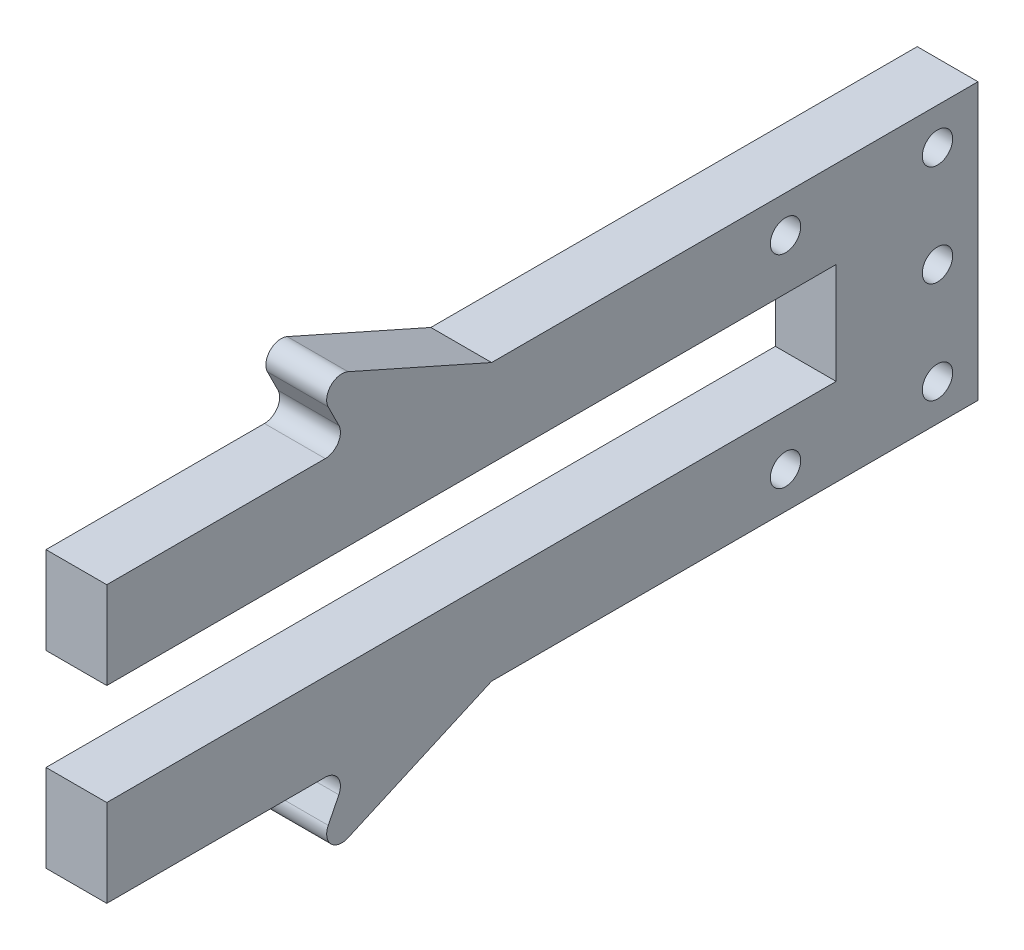
ISO-10303-21;
HEADER;
FILE_DESCRIPTION(('STEP AP214'),'2;1');
FILE_NAME('part.step','',(''),(''),'','','');
FILE_SCHEMA(('AUTOMOTIVE_DESIGN { 1 0 10303 214 1 1 1 1 }'));
ENDSEC;
DATA;
#1=APPLICATION_CONTEXT('core data for automotive mechanical design processes');
#2=APPLICATION_PROTOCOL_DEFINITION('international standard','automotive_design',2000,#1);
#3=PRODUCT_CONTEXT('',#1,'mechanical');
#4=PRODUCT('Part','Part','',(#3));
#5=PRODUCT_RELATED_PRODUCT_CATEGORY('part','',(#4));
#6=PRODUCT_DEFINITION_FORMATION('','',#4);
#7=PRODUCT_DEFINITION_CONTEXT('part definition',#1,'design');
#8=PRODUCT_DEFINITION('design','',#6,#7);
#9=PRODUCT_DEFINITION_SHAPE('','',#8);
#10=(LENGTH_UNIT() NAMED_UNIT(*) SI_UNIT(.MILLI.,.METRE.));
#11=(NAMED_UNIT(*) PLANE_ANGLE_UNIT() SI_UNIT($,.RADIAN.));
#12=(NAMED_UNIT(*) SI_UNIT($,.STERADIAN.) SOLID_ANGLE_UNIT());
#13=UNCERTAINTY_MEASURE_WITH_UNIT(LENGTH_MEASURE(1.E-05),#10,'distance_accuracy_value','');
#14=(GEOMETRIC_REPRESENTATION_CONTEXT(3) GLOBAL_UNCERTAINTY_ASSIGNED_CONTEXT((#13)) GLOBAL_UNIT_ASSIGNED_CONTEXT((#10,
#11,#12)) REPRESENTATION_CONTEXT('',''));
#15=CARTESIAN_POINT('',(0.,0.,0.));
#16=DIRECTION('',(0.,0.,1.));
#17=DIRECTION('',(1.,0.,0.));
#18=AXIS2_PLACEMENT_3D('',#15,#16,#17);
#19=CARTESIAN_POINT('',(3.,-8.69886308258413,20.913575794308));
#20=DIRECTION('',(0.,0.,-1.));
#21=DIRECTION('',(-1.,0.,0.));
#22=AXIS2_PLACEMENT_3D('',#19,#20,#21);
#23=PLANE('',#22);
#24=DIRECTION('',(0.,-1.,0.));
#25=VECTOR('',#24,1.);
#26=CARTESIAN_POINT('',(0.,-8.69886308258413,20.913575794308));
#27=LINE('',#26,#25);
#28=CARTESIAN_POINT('',(0.,-4.38851825499793,20.913575794308));
#29=VERTEX_POINT('',#28);
#30=CARTESIAN_POINT('',(0.,-8.69886308258413,20.913575794308));
#31=VERTEX_POINT('',#30);
#32=EDGE_CURVE('E182',#29,#31,#27,.T.);
#33=ORIENTED_EDGE('',*,*,#32,.T.);
#34=DIRECTION('',(-1.,0.,0.));
#35=VECTOR('',#34,1.);
#36=CARTESIAN_POINT('',(3.,-8.69886308258413,20.913575794308));
#37=LINE('',#36,#35);
#38=CARTESIAN_POINT('',(3.,-8.69886308258413,20.913575794308));
#39=VERTEX_POINT('',#38);
#40=EDGE_CURVE('E164',#39,#31,#37,.T.);
#41=ORIENTED_EDGE('',*,*,#40,.F.);
#42=DIRECTION('',(0.,-1.,0.));
#43=VECTOR('',#42,1.);
#44=CARTESIAN_POINT('',(3.,-8.69886308258413,20.913575794308));
#45=LINE('',#44,#43);
#46=CARTESIAN_POINT('',(3.,-4.38851825499793,20.913575794308));
#47=VERTEX_POINT('',#46);
#48=EDGE_CURVE('E170',#47,#39,#45,.T.);
#49=ORIENTED_EDGE('',*,*,#48,.F.);
#50=DIRECTION('',(-1.,0.,0.));
#51=VECTOR('',#50,1.);
#52=CARTESIAN_POINT('',(3.,-4.38851825499793,20.913575794308));
#53=LINE('',#52,#51);
#54=EDGE_CURVE('E233',#47,#29,#53,.T.);
#55=ORIENTED_EDGE('',*,*,#54,.T.);
#56=EDGE_LOOP('',(#33,#41,#49,#55));
#57=FACE_BOUND('',#56,.T.);
#58=ADVANCED_FACE('F35',(#57),#23,.F.);
#59=CARTESIAN_POINT('',(3.,-8.69886308258413,-15.086424205692));
#60=DIRECTION('',(0.,1.,0.));
#61=DIRECTION('',(0.,0.,1.));
#62=AXIS2_PLACEMENT_3D('',#59,#60,#61);
#63=PLANE('',#62);
#64=DIRECTION('',(0.,0.,-1.));
#65=VECTOR('',#64,1.);
#66=CARTESIAN_POINT('',(0.,-8.69886308258413,-15.086424205692));
#67=LINE('',#66,#65);
#68=CARTESIAN_POINT('',(0.,-8.69886308258413,-15.086424205692));
#69=VERTEX_POINT('',#68);
#70=EDGE_CURVE('E243',#31,#69,#67,.T.);
#71=ORIENTED_EDGE('',*,*,#70,.T.);
#72=DIRECTION('',(-1.,0.,0.));
#73=VECTOR('',#72,1.);
#74=CARTESIAN_POINT('',(3.,-8.69886308258413,-15.086424205692));
#75=LINE('',#74,#73);
#76=CARTESIAN_POINT('',(3.,-8.69886308258413,-15.086424205692));
#77=VERTEX_POINT('',#76);
#78=EDGE_CURVE('E167',#77,#69,#75,.T.);
#79=ORIENTED_EDGE('',*,*,#78,.F.);
#80=DIRECTION('',(0.,0.,-1.));
#81=VECTOR('',#80,1.);
#82=CARTESIAN_POINT('',(3.,-8.69886308258413,-15.086424205692));
#83=LINE('',#82,#81);
#84=EDGE_CURVE('E160',#39,#77,#83,.T.);
#85=ORIENTED_EDGE('',*,*,#84,.F.);
#86=ORIENTED_EDGE('',*,*,#40,.T.);
#87=EDGE_LOOP('',(#71,#79,#85,#86));
#88=FACE_BOUND('',#87,.T.);
#89=ADVANCED_FACE('F162',(#88),#63,.F.);
#90=CARTESIAN_POINT('',(3.,-13.6988630825841,-15.086424205692));
#91=DIRECTION('',(0.,0.,-1.));
#92=DIRECTION('',(0.,1.,0.));
#93=AXIS2_PLACEMENT_3D('',#90,#91,#92);
#94=PLANE('',#93);
#95=DIRECTION('',(0.,-1.,0.));
#96=VECTOR('',#95,1.);
#97=CARTESIAN_POINT('',(0.,-13.6988630825841,-15.086424205692));
#98=LINE('',#97,#96);
#99=CARTESIAN_POINT('',(0.,-13.6988630825841,-15.086424205692));
#100=VERTEX_POINT('',#99);
#101=EDGE_CURVE('E246',#69,#100,#98,.T.);
#102=ORIENTED_EDGE('',*,*,#101,.T.);
#103=DIRECTION('',(-1.,0.,0.));
#104=VECTOR('',#103,1.);
#105=CARTESIAN_POINT('',(3.,-13.6988630825841,-15.086424205692));
#106=LINE('',#105,#104);
#107=CARTESIAN_POINT('',(3.,-13.6988630825841,-15.086424205692));
#108=VERTEX_POINT('',#107);
#109=EDGE_CURVE('E188',#108,#100,#106,.T.);
#110=ORIENTED_EDGE('',*,*,#109,.F.);
#111=DIRECTION('',(0.,-1.,0.));
#112=VECTOR('',#111,1.);
#113=CARTESIAN_POINT('',(3.,-13.6988630825841,-15.086424205692));
#114=LINE('',#113,#112);
#115=EDGE_CURVE('E169',#77,#108,#114,.T.);
#116=ORIENTED_EDGE('',*,*,#115,.F.);
#117=ORIENTED_EDGE('',*,*,#78,.T.);
#118=EDGE_LOOP('',(#102,#110,#116,#117));
#119=FACE_BOUND('',#118,.T.);
#120=ADVANCED_FACE('F373',(#119),#94,.F.);
#121=CARTESIAN_POINT('',(3.,-13.6988630825841,20.913575794308));
#122=DIRECTION('',(0.,-1.,0.));
#123=DIRECTION('',(0.,0.,-1.));
#124=AXIS2_PLACEMENT_3D('',#121,#122,#123);
#125=PLANE('',#124);
#126=DIRECTION('',(0.,0.,1.));
#127=VECTOR('',#126,1.);
#128=CARTESIAN_POINT('',(0.,-13.6988630825841,20.913575794308));
#129=LINE('',#128,#127);
#130=CARTESIAN_POINT('',(0.,-13.6988630825841,20.913575794308));
#131=VERTEX_POINT('',#130);
#132=EDGE_CURVE('E248',#100,#131,#129,.T.);
#133=ORIENTED_EDGE('',*,*,#132,.T.);
#134=DIRECTION('',(-1.,0.,0.));
#135=VECTOR('',#134,1.);
#136=CARTESIAN_POINT('',(3.,-13.6988630825841,20.913575794308));
#137=LINE('',#136,#135);
#138=CARTESIAN_POINT('',(3.,-13.6988630825841,20.913575794308));
#139=VERTEX_POINT('',#138);
#140=EDGE_CURVE('E283',#139,#131,#137,.T.);
#141=ORIENTED_EDGE('',*,*,#140,.F.);
#142=DIRECTION('',(0.,0.,1.));
#143=VECTOR('',#142,1.);
#144=CARTESIAN_POINT('',(3.,-13.6988630825841,20.913575794308));
#145=LINE('',#144,#143);
#146=EDGE_CURVE('E292',#108,#139,#145,.T.);
#147=ORIENTED_EDGE('',*,*,#146,.F.);
#148=ORIENTED_EDGE('',*,*,#109,.T.);
#149=EDGE_LOOP('',(#133,#141,#147,#148));
#150=FACE_BOUND('',#149,.T.);
#151=ADVANCED_FACE('F290',(#150),#125,.F.);
#152=CARTESIAN_POINT('',(3.,-18.0092079101703,20.913575794308));
#153=DIRECTION('',(0.,0.,-1.));
#154=DIRECTION('',(-1.,0.,0.));
#155=AXIS2_PLACEMENT_3D('',#152,#153,#154);
#156=PLANE('',#155);
#157=DIRECTION('',(0.,-1.,0.));
#158=VECTOR('',#157,1.);
#159=CARTESIAN_POINT('',(0.,-18.0092079101703,20.913575794308));
#160=LINE('',#159,#158);
#161=CARTESIAN_POINT('',(0.,-18.0092079101703,20.913575794308));
#162=VERTEX_POINT('',#161);
#163=EDGE_CURVE('E250',#131,#162,#160,.T.);
#164=ORIENTED_EDGE('',*,*,#163,.T.);
#165=DIRECTION('',(-1.,0.,0.));
#166=VECTOR('',#165,1.);
#167=CARTESIAN_POINT('',(3.,-18.0092079101703,20.913575794308));
#168=LINE('',#167,#166);
#169=CARTESIAN_POINT('',(3.,-18.0092079101703,20.913575794308));
#170=VERTEX_POINT('',#169);
#171=EDGE_CURVE('E280',#170,#162,#168,.T.);
#172=ORIENTED_EDGE('',*,*,#171,.F.);
#173=DIRECTION('',(0.,-1.,0.));
#174=VECTOR('',#173,1.);
#175=CARTESIAN_POINT('',(3.,-18.0092079101703,20.913575794308));
#176=LINE('',#175,#174);
#177=EDGE_CURVE('E309',#139,#170,#176,.T.);
#178=ORIENTED_EDGE('',*,*,#177,.F.);
#179=ORIENTED_EDGE('',*,*,#140,.T.);
#180=EDGE_LOOP('',(#164,#172,#178,#179));
#181=FACE_BOUND('',#180,.T.);
#182=ADVANCED_FACE('F299',(#181),#156,.F.);
#183=CARTESIAN_POINT('',(3.,-18.0092079101703,8.91960191493356));
#184=DIRECTION('',(0.,1.,0.));
#185=DIRECTION('',(0.,0.,1.));
#186=AXIS2_PLACEMENT_3D('',#183,#184,#185);
#187=PLANE('',#186);
#188=DIRECTION('',(0.,0.,-1.));
#189=VECTOR('',#188,1.);
#190=CARTESIAN_POINT('',(0.,-18.0092079101703,8.91960191493356));
#191=LINE('',#190,#189);
#192=CARTESIAN_POINT('',(0.,-18.0092079101703,10.1314928126762));
#193=VERTEX_POINT('',#192);
#194=EDGE_CURVE('E252',#162,#193,#191,.T.);
#195=ORIENTED_EDGE('',*,*,#194,.T.);
#196=DIRECTION('',(-1.,0.,0.));
#197=VECTOR('',#196,1.);
#198=CARTESIAN_POINT('',(3.,-18.0092079101703,10.1314928126762));
#199=LINE('',#198,#197);
#200=CARTESIAN_POINT('',(3.,-18.0092079101703,10.1314928126762));
#201=VERTEX_POINT('',#200);
#202=EDGE_CURVE('E204',#193,#201,#199,.F.);
#203=ORIENTED_EDGE('',*,*,#202,.T.);
#204=DIRECTION('',(0.,0.,-1.));
#205=VECTOR('',#204,1.);
#206=CARTESIAN_POINT('',(3.,-18.0092079101703,8.91960191493356));
#207=LINE('',#206,#205);
#208=EDGE_CURVE('E306',#170,#201,#207,.T.);
#209=ORIENTED_EDGE('',*,*,#208,.F.);
#210=ORIENTED_EDGE('',*,*,#171,.T.);
#211=EDGE_LOOP('',(#195,#203,#209,#210));
#212=FACE_BOUND('',#211,.T.);
#213=ADVANCED_FACE('F303',(#212),#187,.F.);
#214=CARTESIAN_POINT('',(3.,-22.0092079101703,10.913575794308));
#215=DIRECTION('',(0.,-0.446134635862029,-0.894965857831601));
#216=DIRECTION('',(0.,0.894965857831602,-0.446134635862029));
#217=AXIS2_PLACEMENT_3D('',#214,#215,#216);
#218=PLANE('',#217);
#219=DIRECTION('',(0.,-0.894965857831602,0.446134635862029));
#220=VECTOR('',#219,1.);
#221=CARTESIAN_POINT('',(0.,-22.0092079101703,10.913575794308));
#222=LINE('',#221,#220);
#223=CARTESIAN_POINT('',(0.,-19.0938088870669,9.46026841930247));
#224=VERTEX_POINT('',#223);
#225=CARTESIAN_POINT('',(0.,-20.1410931179854,9.98233276948552));
#226=VERTEX_POINT('',#225);
#227=EDGE_CURVE('E255',#224,#226,#222,.T.);
#228=ORIENTED_EDGE('',*,*,#227,.T.);
#229=DIRECTION('',(-1.,0.,0.));
#230=VECTOR('',#229,1.);
#231=CARTESIAN_POINT('',(3.,-20.1410931179854,9.98233276948552));
#232=LINE('',#231,#230);
#233=CARTESIAN_POINT('',(3.,-20.1410931179854,9.98233276948552));
#234=VERTEX_POINT('',#233);
#235=EDGE_CURVE('E198',#226,#234,#232,.F.);
#236=ORIENTED_EDGE('',*,*,#235,.T.);
#237=DIRECTION('',(0.,-0.894965857831602,0.446134635862029));
#238=VECTOR('',#237,1.);
#239=CARTESIAN_POINT('',(3.,-22.0092079101703,10.913575794308));
#240=LINE('',#239,#238);
#241=CARTESIAN_POINT('',(3.,-19.0938088870669,9.46026841930247));
#242=VERTEX_POINT('',#241);
#243=EDGE_CURVE('E308',#242,#234,#240,.T.);
#244=ORIENTED_EDGE('',*,*,#243,.F.);
#245=DIRECTION('',(-1.,0.,0.));
#246=VECTOR('',#245,1.);
#247=CARTESIAN_POINT('',(0.,-19.0938088870669,9.46026841930247));
#248=LINE('',#247,#246);
#249=EDGE_CURVE('E195',#242,#224,#248,.T.);
#250=ORIENTED_EDGE('',*,*,#249,.T.);
#251=EDGE_LOOP('',(#228,#236,#244,#250));
#252=FACE_BOUND('',#251,.T.);
#253=ADVANCED_FACE('F354',(#252),#218,.F.);
#254=CARTESIAN_POINT('',(3.,-18.0092079101703,1.91960191493357));
#255=DIRECTION('',(0.,0.913710538579925,0.406365662535583));
#256=DIRECTION('',(0.,-0.406365662535583,0.913710538579925));
#257=AXIS2_PLACEMENT_3D('',#254,#255,#256);
#258=PLANE('',#257);
#259=DIRECTION('',(0.,0.406365662535583,-0.913710538579925));
#260=VECTOR('',#259,1.);
#261=CARTESIAN_POINT('',(3.,-18.0092079101703,1.91960191493357));
#262=LINE('',#261,#260);
#263=CARTESIAN_POINT('',(3.,-21.1609769988168,9.00633412921013));
#264=VERTEX_POINT('',#263);
#265=CARTESIAN_POINT('',(3.,-18.0092079101703,1.91960191493357));
#266=VERTEX_POINT('',#265);
#267=EDGE_CURVE('E311',#264,#266,#262,.T.);
#268=ORIENTED_EDGE('',*,*,#267,.F.);
#269=DIRECTION('',(-1.,0.,0.));
#270=VECTOR('',#269,1.);
#271=CARTESIAN_POINT('',(3.,-21.1609769988168,9.00633412921013));
#272=LINE('',#271,#270);
#273=CARTESIAN_POINT('',(0.,-21.1609769988168,9.00633412921013));
#274=VERTEX_POINT('',#273);
#275=EDGE_CURVE('E183',#264,#274,#272,.T.);
#276=ORIENTED_EDGE('',*,*,#275,.T.);
#277=DIRECTION('',(0.,0.406365662535583,-0.913710538579925));
#278=VECTOR('',#277,1.);
#279=CARTESIAN_POINT('',(0.,-18.0092079101703,1.91960191493357));
#280=LINE('',#279,#278);
#281=CARTESIAN_POINT('',(0.,-18.0092079101703,1.91960191493357));
#282=VERTEX_POINT('',#281);
#283=EDGE_CURVE('E258',#274,#282,#280,.T.);
#284=ORIENTED_EDGE('',*,*,#283,.T.);
#285=DIRECTION('',(-1.,0.,0.));
#286=VECTOR('',#285,1.);
#287=CARTESIAN_POINT('',(3.,-18.0092079101703,1.91960191493357));
#288=LINE('',#287,#286);
#289=EDGE_CURVE('E277',#266,#282,#288,.T.);
#290=ORIENTED_EDGE('',*,*,#289,.F.);
#291=EDGE_LOOP('',(#268,#276,#284,#290));
#292=FACE_BOUND('',#291,.T.);
#293=ADVANCED_FACE('F348',(#292),#258,.F.);
#294=CARTESIAN_POINT('',(3.,-18.0092079101703,-22.086424205692));
#295=DIRECTION('',(0.,1.,0.));
#296=DIRECTION('',(0.,0.,1.));
#297=AXIS2_PLACEMENT_3D('',#294,#295,#296);
#298=PLANE('',#297);
#299=DIRECTION('',(0.,0.,-1.));
#300=VECTOR('',#299,1.);
#301=CARTESIAN_POINT('',(0.,-18.0092079101703,-22.086424205692));
#302=LINE('',#301,#300);
#303=CARTESIAN_POINT('',(0.,-18.0092079101703,-22.086424205692));
#304=VERTEX_POINT('',#303);
#305=EDGE_CURVE('E260',#282,#304,#302,.T.);
#306=ORIENTED_EDGE('',*,*,#305,.T.);
#307=DIRECTION('',(-1.,0.,0.));
#308=VECTOR('',#307,1.);
#309=CARTESIAN_POINT('',(3.,-18.0092079101703,-22.086424205692));
#310=LINE('',#309,#308);
#311=CARTESIAN_POINT('',(3.,-18.0092079101703,-22.086424205692));
#312=VERTEX_POINT('',#311);
#313=EDGE_CURVE('E274',#312,#304,#310,.T.);
#314=ORIENTED_EDGE('',*,*,#313,.F.);
#315=DIRECTION('',(0.,0.,-1.));
#316=VECTOR('',#315,1.);
#317=CARTESIAN_POINT('',(3.,-18.0092079101703,-22.086424205692));
#318=LINE('',#317,#316);
#319=EDGE_CURVE('E317',#266,#312,#318,.T.);
#320=ORIENTED_EDGE('',*,*,#319,.F.);
#321=ORIENTED_EDGE('',*,*,#289,.T.);
#322=EDGE_LOOP('',(#306,#314,#320,#321));
#323=FACE_BOUND('',#322,.T.);
#324=ADVANCED_FACE('F344',(#323),#298,.F.);
#325=CARTESIAN_POINT('',(3.,-4.38851825499794,-22.086424205692));
#326=DIRECTION('',(0.,0.,1.));
#327=DIRECTION('',(1.,0.,0.));
#328=AXIS2_PLACEMENT_3D('',#325,#326,#327);
#329=PLANE('',#328);
#330=DIRECTION('',(0.,1.,0.));
#331=VECTOR('',#330,1.);
#332=CARTESIAN_POINT('',(0.,-4.38851825499794,-22.086424205692));
#333=LINE('',#332,#331);
#334=CARTESIAN_POINT('',(0.,-4.38851825499794,-22.086424205692));
#335=VERTEX_POINT('',#334);
#336=EDGE_CURVE('E262',#304,#335,#333,.T.);
#337=ORIENTED_EDGE('',*,*,#336,.T.);
#338=DIRECTION('',(-1.,0.,0.));
#339=VECTOR('',#338,1.);
#340=CARTESIAN_POINT('',(3.,-4.38851825499794,-22.086424205692));
#341=LINE('',#340,#339);
#342=CARTESIAN_POINT('',(3.,-4.38851825499794,-22.086424205692));
#343=VERTEX_POINT('',#342);
#344=EDGE_CURVE('E271',#343,#335,#341,.T.);
#345=ORIENTED_EDGE('',*,*,#344,.F.);
#346=DIRECTION('',(0.,1.,0.));
#347=VECTOR('',#346,1.);
#348=CARTESIAN_POINT('',(3.,-4.38851825499794,-22.086424205692));
#349=LINE('',#348,#347);
#350=EDGE_CURVE('E319',#312,#343,#349,.T.);
#351=ORIENTED_EDGE('',*,*,#350,.F.);
#352=ORIENTED_EDGE('',*,*,#313,.T.);
#353=EDGE_LOOP('',(#337,#345,#351,#352));
#354=FACE_BOUND('',#353,.T.);
#355=ADVANCED_FACE('F339',(#354),#329,.F.);
#356=CARTESIAN_POINT('',(3.,-4.38851825499793,1.91960191493359));
#357=DIRECTION('',(0.,-1.,0.));
#358=DIRECTION('',(0.,0.,-1.));
#359=AXIS2_PLACEMENT_3D('',#356,#357,#358);
#360=PLANE('',#359);
#361=DIRECTION('',(0.,0.,1.));
#362=VECTOR('',#361,1.);
#363=CARTESIAN_POINT('',(0.,-4.38851825499793,1.91960191493359));
#364=LINE('',#363,#362);
#365=CARTESIAN_POINT('',(0.,-4.38851825499793,1.91960191493359));
#366=VERTEX_POINT('',#365);
#367=EDGE_CURVE('E264',#335,#366,#364,.T.);
#368=ORIENTED_EDGE('',*,*,#367,.T.);
#369=DIRECTION('',(-1.,0.,0.));
#370=VECTOR('',#369,1.);
#371=CARTESIAN_POINT('',(3.,-4.38851825499793,1.91960191493359));
#372=LINE('',#371,#370);
#373=CARTESIAN_POINT('',(3.,-4.38851825499793,1.91960191493359));
#374=VERTEX_POINT('',#373);
#375=EDGE_CURVE('E236',#374,#366,#372,.T.);
#376=ORIENTED_EDGE('',*,*,#375,.F.);
#377=DIRECTION('',(0.,0.,1.));
#378=VECTOR('',#377,1.);
#379=CARTESIAN_POINT('',(3.,-4.38851825499793,1.91960191493359));
#380=LINE('',#379,#378);
#381=EDGE_CURVE('E321',#343,#374,#380,.T.);
#382=ORIENTED_EDGE('',*,*,#381,.F.);
#383=ORIENTED_EDGE('',*,*,#344,.T.);
#384=EDGE_LOOP('',(#368,#376,#382,#383));
#385=FACE_BOUND('',#384,.T.);
#386=ADVANCED_FACE('F334',(#385),#360,.F.);
#387=CARTESIAN_POINT('',(3.,-4.38851825499793,1.91960191493359));
#388=DIRECTION('',(0.,-0.913710538579925,0.406365662535582));
#389=DIRECTION('',(0.,-0.406365662535583,-0.913710538579925));
#390=AXIS2_PLACEMENT_3D('',#387,#388,#389);
#391=PLANE('',#390);
#392=DIRECTION('',(0.,0.406365662535583,0.913710538579925));
#393=VECTOR('',#392,1.);
#394=CARTESIAN_POINT('',(0.,-4.38851825499793,1.91960191493359));
#395=LINE('',#394,#393);
#396=CARTESIAN_POINT('',(0.,-1.23674916635143,9.00633412921016));
#397=VERTEX_POINT('',#396);
#398=EDGE_CURVE('E228',#366,#397,#395,.T.);
#399=ORIENTED_EDGE('',*,*,#398,.T.);
#400=DIRECTION('',(-1.,0.,0.));
#401=VECTOR('',#400,1.);
#402=CARTESIAN_POINT('',(3.,-1.23674916635143,9.00633412921016));
#403=LINE('',#402,#401);
#404=CARTESIAN_POINT('',(3.,-1.23674916635143,9.00633412921016));
#405=VERTEX_POINT('',#404);
#406=EDGE_CURVE('E213',#397,#405,#403,.F.);
#407=ORIENTED_EDGE('',*,*,#406,.T.);
#408=DIRECTION('',(0.,0.406365662535583,0.913710538579925));
#409=VECTOR('',#408,1.);
#410=CARTESIAN_POINT('',(3.,-4.38851825499793,1.91960191493359));
#411=LINE('',#410,#409);
#412=EDGE_CURVE('E238',#374,#405,#411,.T.);
#413=ORIENTED_EDGE('',*,*,#412,.F.);
#414=ORIENTED_EDGE('',*,*,#375,.T.);
#415=EDGE_LOOP('',(#399,#407,#413,#414));
#416=FACE_BOUND('',#415,.T.);
#417=ADVANCED_FACE('F332',(#416),#391,.F.);
#418=CARTESIAN_POINT('',(3.,-0.388518254997929,10.913575794308));
#419=DIRECTION('',(0.,0.446134635862029,-0.894965857831602));
#420=DIRECTION('',(0.,0.894965857831602,0.446134635862029));
#421=AXIS2_PLACEMENT_3D('',#418,#419,#420);
#422=PLANE('',#421);
#423=DIRECTION('',(0.,-0.894965857831602,-0.446134635862029));
#424=VECTOR('',#423,1.);
#425=CARTESIAN_POINT('',(0.,-0.388518254997929,10.913575794308));
#426=LINE('',#425,#424);
#427=CARTESIAN_POINT('',(0.,-2.25663304718289,9.98233276948555));
#428=VERTEX_POINT('',#427);
#429=CARTESIAN_POINT('',(0.,-3.30391727810141,9.46026841930249));
#430=VERTEX_POINT('',#429);
#431=EDGE_CURVE('E223',#428,#430,#426,.T.);
#432=ORIENTED_EDGE('',*,*,#431,.T.);
#433=DIRECTION('',(-1.,0.,0.));
#434=VECTOR('',#433,1.);
#435=CARTESIAN_POINT('',(3.,-3.30391727810141,9.46026841930249));
#436=LINE('',#435,#434);
#437=CARTESIAN_POINT('',(3.,-3.30391727810141,9.46026841930249));
#438=VERTEX_POINT('',#437);
#439=EDGE_CURVE('E56',#430,#438,#436,.F.);
#440=ORIENTED_EDGE('',*,*,#439,.T.);
#441=DIRECTION('',(0.,-0.894965857831602,-0.446134635862029));
#442=VECTOR('',#441,1.);
#443=CARTESIAN_POINT('',(3.,-0.388518254997929,10.913575794308));
#444=LINE('',#443,#442);
#445=CARTESIAN_POINT('',(3.,-2.25663304718289,9.98233276948555));
#446=VERTEX_POINT('',#445);
#447=EDGE_CURVE('E234',#446,#438,#444,.T.);
#448=ORIENTED_EDGE('',*,*,#447,.F.);
#449=DIRECTION('',(-1.,0.,0.));
#450=VECTOR('',#449,1.);
#451=CARTESIAN_POINT('',(3.,-2.25663304718289,9.98233276948555));
#452=LINE('',#451,#450);
#453=EDGE_CURVE('E209',#446,#428,#452,.T.);
#454=ORIENTED_EDGE('',*,*,#453,.T.);
#455=EDGE_LOOP('',(#432,#440,#448,#454));
#456=FACE_BOUND('',#455,.T.);
#457=ADVANCED_FACE('F226',(#456),#422,.F.);
#458=CARTESIAN_POINT('',(3.,-4.38851825499793,20.913575794308));
#459=DIRECTION('',(0.,-1.,0.));
#460=DIRECTION('',(0.,0.,-1.));
#461=AXIS2_PLACEMENT_3D('',#458,#459,#460);
#462=PLANE('',#461);
#463=DIRECTION('',(0.,0.,1.));
#464=VECTOR('',#463,1.);
#465=CARTESIAN_POINT('',(3.,-4.38851825499793,20.913575794308));
#466=LINE('',#465,#464);
#467=CARTESIAN_POINT('',(3.,-4.38851825499793,10.1314928126762));
#468=VERTEX_POINT('',#467);
#469=EDGE_CURVE('E175',#468,#47,#466,.T.);
#470=ORIENTED_EDGE('',*,*,#469,.F.);
#471=DIRECTION('',(-1.,0.,0.));
#472=VECTOR('',#471,1.);
#473=CARTESIAN_POINT('',(0.,-4.38851825499793,10.1314928126762));
#474=LINE('',#473,#472);
#475=CARTESIAN_POINT('',(0.,-4.38851825499793,10.1314928126762));
#476=VERTEX_POINT('',#475);
#477=EDGE_CURVE('E206',#468,#476,#474,.T.);
#478=ORIENTED_EDGE('',*,*,#477,.T.);
#479=DIRECTION('',(0.,0.,1.));
#480=VECTOR('',#479,1.);
#481=CARTESIAN_POINT('',(0.,-4.38851825499793,20.913575794308));
#482=LINE('',#481,#480);
#483=EDGE_CURVE('E179',#476,#29,#482,.T.);
#484=ORIENTED_EDGE('',*,*,#483,.T.);
#485=ORIENTED_EDGE('',*,*,#54,.F.);
#486=EDGE_LOOP('',(#470,#478,#484,#485));
#487=FACE_BOUND('',#486,.T.);
#488=ADVANCED_FACE('F232',(#487),#462,.F.);
#489=CARTESIAN_POINT('',(3.,0.,0.));
#490=DIRECTION('',(-1.,0.,0.));
#491=DIRECTION('',(0.,0.,1.));
#492=AXIS2_PLACEMENT_3D('',#489,#490,#491);
#493=PLANE('',#492);
#494=CARTESIAN_POINT('',(3.,-16.1988630825841,-20.086424205692));
#495=DIRECTION('',(1.,0.,0.));
#496=DIRECTION('',(0.,0.,-1.));
#497=AXIS2_PLACEMENT_3D('',#494,#495,#496);
#498=CIRCLE('',#497,0.750000000000002);
#499=CARTESIAN_POINT('',(3.,-16.1988630825841,-20.836424205692));
#500=VERTEX_POINT('',#499);
#501=EDGE_CURVE('E449',#500,#500,#498,.T.);
#502=ORIENTED_EDGE('',*,*,#501,.F.);
#503=EDGE_LOOP('',(#502));
#504=FACE_BOUND('',#503,.T.);
#505=CARTESIAN_POINT('',(3.,-6.19886308258413,-12.586424205692));
#506=DIRECTION('',(1.,0.,0.));
#507=DIRECTION('',(0.,0.,-1.));
#508=AXIS2_PLACEMENT_3D('',#505,#506,#507);
#509=CIRCLE('',#508,0.75);
#510=CARTESIAN_POINT('',(3.,-6.19886308258413,-13.336424205692));
#511=VERTEX_POINT('',#510);
#512=EDGE_CURVE('E437',#511,#511,#509,.T.);
#513=ORIENTED_EDGE('',*,*,#512,.F.);
#514=EDGE_LOOP('',(#513));
#515=FACE_BOUND('',#514,.T.);
#516=CARTESIAN_POINT('',(3.,-11.1988630825841,-20.086424205692));
#517=DIRECTION('',(1.,0.,0.));
#518=DIRECTION('',(0.,0.,-1.));
#519=AXIS2_PLACEMENT_3D('',#516,#517,#518);
#520=CIRCLE('',#519,0.750000000000002);
#521=CARTESIAN_POINT('',(3.,-11.1988630825841,-20.836424205692));
#522=VERTEX_POINT('',#521);
#523=EDGE_CURVE('E433',#522,#522,#520,.T.);
#524=ORIENTED_EDGE('',*,*,#523,.F.);
#525=EDGE_LOOP('',(#524));
#526=FACE_BOUND('',#525,.T.);
#527=CARTESIAN_POINT('',(3.,-16.1988630825841,-12.586424205692));
#528=DIRECTION('',(1.,0.,0.));
#529=DIRECTION('',(0.,0.,-1.));
#530=AXIS2_PLACEMENT_3D('',#527,#528,#529);
#531=CIRCLE('',#530,0.75);
#532=CARTESIAN_POINT('',(3.,-16.1988630825841,-13.336424205692));
#533=VERTEX_POINT('',#532);
#534=EDGE_CURVE('E440',#533,#533,#531,.T.);
#535=ORIENTED_EDGE('',*,*,#534,.F.);
#536=EDGE_LOOP('',(#535));
#537=FACE_BOUND('',#536,.T.);
#538=CARTESIAN_POINT('',(3.,-6.19886308258413,-20.086424205692));
#539=DIRECTION('',(1.,0.,0.));
#540=DIRECTION('',(0.,0.,-1.));
#541=AXIS2_PLACEMENT_3D('',#538,#539,#540);
#542=CIRCLE('',#541,0.750000000000002);
#543=CARTESIAN_POINT('',(3.,-6.19886308258413,-20.836424205692));
#544=VERTEX_POINT('',#543);
#545=EDGE_CURVE('E448',#544,#544,#542,.T.);
#546=ORIENTED_EDGE('',*,*,#545,.F.);
#547=EDGE_LOOP('',(#546));
#548=FACE_BOUND('',#547,.T.);
#549=ORIENTED_EDGE('',*,*,#243,.T.);
#550=CARTESIAN_POINT('',(3.,-20.4756940948819,9.31110837611182));
#551=DIRECTION('',(-1.,0.,0.));
#552=DIRECTION('',(0.,0.,1.));
#553=AXIS2_PLACEMENT_3D('',#550,#551,#552);
#554=CIRCLE('',#553,0.75);
#555=EDGE_CURVE('E202',#234,#264,#554,.F.);
#556=ORIENTED_EDGE('',*,*,#555,.T.);
#557=ORIENTED_EDGE('',*,*,#267,.T.);
#558=ORIENTED_EDGE('',*,*,#319,.T.);
#559=ORIENTED_EDGE('',*,*,#350,.T.);
#560=ORIENTED_EDGE('',*,*,#381,.T.);
#561=ORIENTED_EDGE('',*,*,#412,.T.);
#562=CARTESIAN_POINT('',(3.,-1.92203207028637,9.31110837611185));
#563=DIRECTION('',(-1.,0.,0.));
#564=DIRECTION('',(0.,0.,1.));
#565=AXIS2_PLACEMENT_3D('',#562,#563,#564);
#566=CIRCLE('',#565,0.75);
#567=EDGE_CURVE('E200',#405,#446,#566,.F.);
#568=ORIENTED_EDGE('',*,*,#567,.T.);
#569=ORIENTED_EDGE('',*,*,#447,.T.);
#570=CARTESIAN_POINT('',(3.,-3.63851825499793,10.1314928126762));
#571=DIRECTION('',(-1.,0.,0.));
#572=DIRECTION('',(0.,0.,1.));
#573=AXIS2_PLACEMENT_3D('',#570,#571,#572);
#574=CIRCLE('',#573,0.75);
#575=EDGE_CURVE('E11',#438,#468,#574,.T.);
#576=ORIENTED_EDGE('',*,*,#575,.T.);
#577=ORIENTED_EDGE('',*,*,#469,.T.);
#578=ORIENTED_EDGE('',*,*,#48,.T.);
#579=ORIENTED_EDGE('',*,*,#84,.T.);
#580=ORIENTED_EDGE('',*,*,#115,.T.);
#581=ORIENTED_EDGE('',*,*,#146,.T.);
#582=ORIENTED_EDGE('',*,*,#177,.T.);
#583=ORIENTED_EDGE('',*,*,#208,.T.);
#584=CARTESIAN_POINT('',(3.,-18.7592079101703,10.1314928126762));
#585=DIRECTION('',(-1.,0.,0.));
#586=DIRECTION('',(0.,0.,1.));
#587=AXIS2_PLACEMENT_3D('',#584,#585,#586);
#588=CIRCLE('',#587,0.75);
#589=EDGE_CURVE('E217',#201,#242,#588,.T.);
#590=ORIENTED_EDGE('',*,*,#589,.T.);
#591=EDGE_LOOP('',(#549,#556,#557,#558,#559,#560,#561,#568,#569,#576,#577,#578,#579,#580,#581,
#582,#583,#590));
#592=FACE_BOUND('',#591,.T.);
#593=ADVANCED_FACE('F174',(#504,#515,#526,#537,#548,#592),#493,.F.);
#594=CARTESIAN_POINT('',(0.,0.,0.));
#595=DIRECTION('',(-1.,0.,0.));
#596=DIRECTION('',(0.,0.,1.));
#597=AXIS2_PLACEMENT_3D('',#594,#595,#596);
#598=PLANE('',#597);
#599=CARTESIAN_POINT('',(0.,-16.1988630825841,-20.086424205692));
#600=DIRECTION('',(1.,0.,0.));
#601=DIRECTION('',(0.,0.,-1.));
#602=AXIS2_PLACEMENT_3D('',#599,#600,#601);
#603=CIRCLE('',#602,0.750000000000002);
#604=CARTESIAN_POINT('',(0.,-16.1988630825841,-20.836424205692));
#605=VERTEX_POINT('',#604);
#606=EDGE_CURVE('E445',#605,#605,#603,.T.);
#607=ORIENTED_EDGE('',*,*,#606,.T.);
#608=EDGE_LOOP('',(#607));
#609=FACE_BOUND('',#608,.T.);
#610=CARTESIAN_POINT('',(0.,-6.19886308258413,-12.586424205692));
#611=DIRECTION('',(1.,0.,0.));
#612=DIRECTION('',(0.,0.,-1.));
#613=AXIS2_PLACEMENT_3D('',#610,#611,#612);
#614=CIRCLE('',#613,0.75);
#615=CARTESIAN_POINT('',(0.,-6.19886308258413,-13.336424205692));
#616=VERTEX_POINT('',#615);
#617=EDGE_CURVE('E452',#616,#616,#614,.T.);
#618=ORIENTED_EDGE('',*,*,#617,.T.);
#619=EDGE_LOOP('',(#618));
#620=FACE_BOUND('',#619,.T.);
#621=CARTESIAN_POINT('',(0.,-11.1988630825841,-20.086424205692));
#622=DIRECTION('',(1.,0.,0.));
#623=DIRECTION('',(0.,0.,-1.));
#624=AXIS2_PLACEMENT_3D('',#621,#622,#623);
#625=CIRCLE('',#624,0.750000000000002);
#626=CARTESIAN_POINT('',(0.,-11.1988630825841,-20.836424205692));
#627=VERTEX_POINT('',#626);
#628=EDGE_CURVE('E430',#627,#627,#625,.T.);
#629=ORIENTED_EDGE('',*,*,#628,.T.);
#630=EDGE_LOOP('',(#629));
#631=FACE_BOUND('',#630,.T.);
#632=CARTESIAN_POINT('',(0.,-16.1988630825841,-12.586424205692));
#633=DIRECTION('',(1.,0.,0.));
#634=DIRECTION('',(0.,0.,-1.));
#635=AXIS2_PLACEMENT_3D('',#632,#633,#634);
#636=CIRCLE('',#635,0.75);
#637=CARTESIAN_POINT('',(0.,-16.1988630825841,-13.336424205692));
#638=VERTEX_POINT('',#637);
#639=EDGE_CURVE('E435',#638,#638,#636,.T.);
#640=ORIENTED_EDGE('',*,*,#639,.T.);
#641=EDGE_LOOP('',(#640));
#642=FACE_BOUND('',#641,.T.);
#643=CARTESIAN_POINT('',(0.,-6.19886308258413,-20.086424205692));
#644=DIRECTION('',(1.,0.,0.));
#645=DIRECTION('',(0.,0.,-1.));
#646=AXIS2_PLACEMENT_3D('',#643,#644,#645);
#647=CIRCLE('',#646,0.750000000000002);
#648=CARTESIAN_POINT('',(0.,-6.19886308258413,-20.836424205692));
#649=VERTEX_POINT('',#648);
#650=EDGE_CURVE('E244',#649,#649,#647,.T.);
#651=ORIENTED_EDGE('',*,*,#650,.T.);
#652=EDGE_LOOP('',(#651));
#653=FACE_BOUND('',#652,.T.);
#654=ORIENTED_EDGE('',*,*,#283,.F.);
#655=CARTESIAN_POINT('',(0.,-20.4756940948819,9.31110837611182));
#656=DIRECTION('',(-1.,0.,0.));
#657=DIRECTION('',(0.,0.,1.));
#658=AXIS2_PLACEMENT_3D('',#655,#656,#657);
#659=CIRCLE('',#658,0.75);
#660=EDGE_CURVE('E193',#274,#226,#659,.T.);
#661=ORIENTED_EDGE('',*,*,#660,.T.);
#662=ORIENTED_EDGE('',*,*,#227,.F.);
#663=CARTESIAN_POINT('',(0.,-18.7592079101703,10.1314928126762));
#664=DIRECTION('',(-1.,0.,0.));
#665=DIRECTION('',(0.,0.,1.));
#666=AXIS2_PLACEMENT_3D('',#663,#664,#665);
#667=CIRCLE('',#666,0.75);
#668=EDGE_CURVE('E215',#224,#193,#667,.F.);
#669=ORIENTED_EDGE('',*,*,#668,.T.);
#670=ORIENTED_EDGE('',*,*,#194,.F.);
#671=ORIENTED_EDGE('',*,*,#163,.F.);
#672=ORIENTED_EDGE('',*,*,#132,.F.);
#673=ORIENTED_EDGE('',*,*,#101,.F.);
#674=ORIENTED_EDGE('',*,*,#70,.F.);
#675=ORIENTED_EDGE('',*,*,#32,.F.);
#676=ORIENTED_EDGE('',*,*,#483,.F.);
#677=CARTESIAN_POINT('',(0.,-3.63851825499793,10.1314928126762));
#678=DIRECTION('',(-1.,0.,0.));
#679=DIRECTION('',(0.,0.,1.));
#680=AXIS2_PLACEMENT_3D('',#677,#678,#679);
#681=CIRCLE('',#680,0.75);
#682=EDGE_CURVE('E43',#476,#430,#681,.F.);
#683=ORIENTED_EDGE('',*,*,#682,.T.);
#684=ORIENTED_EDGE('',*,*,#431,.F.);
#685=CARTESIAN_POINT('',(0.,-1.92203207028637,9.31110837611185));
#686=DIRECTION('',(-1.,0.,0.));
#687=DIRECTION('',(0.,0.,1.));
#688=AXIS2_PLACEMENT_3D('',#685,#686,#687);
#689=CIRCLE('',#688,0.75);
#690=EDGE_CURVE('E186',#428,#397,#689,.T.);
#691=ORIENTED_EDGE('',*,*,#690,.T.);
#692=ORIENTED_EDGE('',*,*,#398,.F.);
#693=ORIENTED_EDGE('',*,*,#367,.F.);
#694=ORIENTED_EDGE('',*,*,#336,.F.);
#695=ORIENTED_EDGE('',*,*,#305,.F.);
#696=EDGE_LOOP('',(#654,#661,#662,#669,#670,#671,#672,#673,#674,#675,#676,#683,#684,#691,#692,
#693,#694,#695));
#697=FACE_BOUND('',#696,.T.);
#698=ADVANCED_FACE('F222',(#609,#620,#631,#642,#653,#697),#598,.T.);
#699=CARTESIAN_POINT('',(3.,-20.4756940948819,9.31110837611182));
#700=DIRECTION('',(-1.,0.,0.));
#701=DIRECTION('',(0.,0.,1.));
#702=AXIS2_PLACEMENT_3D('',#699,#700,#701);
#703=CYLINDRICAL_SURFACE('',#702,0.75);
#704=ORIENTED_EDGE('',*,*,#555,.F.);
#705=ORIENTED_EDGE('',*,*,#235,.F.);
#706=ORIENTED_EDGE('',*,*,#660,.F.);
#707=ORIENTED_EDGE('',*,*,#275,.F.);
#708=EDGE_LOOP('',(#704,#705,#706,#707));
#709=FACE_BOUND('',#708,.T.);
#710=ADVANCED_FACE('F358',(#709),#703,.T.);
#711=CARTESIAN_POINT('',(3.,-18.7592079101703,10.1314928126762));
#712=DIRECTION('',(1.,0.,0.));
#713=DIRECTION('',(0.,0.,-1.));
#714=AXIS2_PLACEMENT_3D('',#711,#712,#713);
#715=CYLINDRICAL_SURFACE('',#714,0.75);
#716=ORIENTED_EDGE('',*,*,#589,.F.);
#717=ORIENTED_EDGE('',*,*,#202,.F.);
#718=ORIENTED_EDGE('',*,*,#668,.F.);
#719=ORIENTED_EDGE('',*,*,#249,.F.);
#720=EDGE_LOOP('',(#716,#717,#718,#719));
#721=FACE_BOUND('',#720,.T.);
#722=ADVANCED_FACE('F360',(#721),#715,.F.);
#723=CARTESIAN_POINT('',(3.,-3.63851825499793,10.1314928126762));
#724=DIRECTION('',(1.,0.,0.));
#725=DIRECTION('',(0.,0.,-1.));
#726=AXIS2_PLACEMENT_3D('',#723,#724,#725);
#727=CYLINDRICAL_SURFACE('',#726,0.75);
#728=ORIENTED_EDGE('',*,*,#575,.F.);
#729=ORIENTED_EDGE('',*,*,#439,.F.);
#730=ORIENTED_EDGE('',*,*,#682,.F.);
#731=ORIENTED_EDGE('',*,*,#477,.F.);
#732=EDGE_LOOP('',(#728,#729,#730,#731));
#733=FACE_BOUND('',#732,.T.);
#734=ADVANCED_FACE('F230',(#733),#727,.F.);
#735=CARTESIAN_POINT('',(3.,-1.92203207028637,9.31110837611185));
#736=DIRECTION('',(-1.,0.,0.));
#737=DIRECTION('',(0.,0.,1.));
#738=AXIS2_PLACEMENT_3D('',#735,#736,#737);
#739=CYLINDRICAL_SURFACE('',#738,0.75);
#740=ORIENTED_EDGE('',*,*,#567,.F.);
#741=ORIENTED_EDGE('',*,*,#406,.F.);
#742=ORIENTED_EDGE('',*,*,#690,.F.);
#743=ORIENTED_EDGE('',*,*,#453,.F.);
#744=EDGE_LOOP('',(#740,#741,#742,#743));
#745=FACE_BOUND('',#744,.T.);
#746=ADVANCED_FACE('F37',(#745),#739,.T.);
#747=CARTESIAN_POINT('',(0.,-6.19886308258413,-20.086424205692));
#748=DIRECTION('',(1.,0.,0.));
#749=DIRECTION('',(0.,0.,-1.));
#750=AXIS2_PLACEMENT_3D('',#747,#748,#749);
#751=CYLINDRICAL_SURFACE('',#750,0.750000000000002);
#752=ORIENTED_EDGE('',*,*,#650,.F.);
#753=EDGE_LOOP('',(#752));
#754=FACE_BOUND('',#753,.T.);
#755=ORIENTED_EDGE('',*,*,#545,.T.);
#756=EDGE_LOOP('',(#755));
#757=FACE_BOUND('',#756,.T.);
#758=ADVANCED_FACE('F406',(#754,#757),#751,.F.);
#759=CARTESIAN_POINT('',(0.,-16.1988630825841,-12.586424205692));
#760=DIRECTION('',(1.,0.,0.));
#761=DIRECTION('',(0.,0.,-1.));
#762=AXIS2_PLACEMENT_3D('',#759,#760,#761);
#763=CYLINDRICAL_SURFACE('',#762,0.75);
#764=ORIENTED_EDGE('',*,*,#639,.F.);
#765=EDGE_LOOP('',(#764));
#766=FACE_BOUND('',#765,.T.);
#767=ORIENTED_EDGE('',*,*,#534,.T.);
#768=EDGE_LOOP('',(#767));
#769=FACE_BOUND('',#768,.T.);
#770=ADVANCED_FACE('F409',(#766,#769),#763,.F.);
#771=CARTESIAN_POINT('',(0.,-11.1988630825841,-20.086424205692));
#772=DIRECTION('',(1.,0.,0.));
#773=DIRECTION('',(0.,0.,-1.));
#774=AXIS2_PLACEMENT_3D('',#771,#772,#773);
#775=CYLINDRICAL_SURFACE('',#774,0.750000000000002);
#776=ORIENTED_EDGE('',*,*,#628,.F.);
#777=EDGE_LOOP('',(#776));
#778=FACE_BOUND('',#777,.T.);
#779=ORIENTED_EDGE('',*,*,#523,.T.);
#780=EDGE_LOOP('',(#779));
#781=FACE_BOUND('',#780,.T.);
#782=ADVANCED_FACE('F415',(#778,#781),#775,.F.);
#783=CARTESIAN_POINT('',(0.,-6.19886308258413,-12.586424205692));
#784=DIRECTION('',(1.,0.,0.));
#785=DIRECTION('',(0.,0.,-1.));
#786=AXIS2_PLACEMENT_3D('',#783,#784,#785);
#787=CYLINDRICAL_SURFACE('',#786,0.75);
#788=ORIENTED_EDGE('',*,*,#617,.F.);
#789=EDGE_LOOP('',(#788));
#790=FACE_BOUND('',#789,.T.);
#791=ORIENTED_EDGE('',*,*,#512,.T.);
#792=EDGE_LOOP('',(#791));
#793=FACE_BOUND('',#792,.T.);
#794=ADVANCED_FACE('F411',(#790,#793),#787,.F.);
#795=CARTESIAN_POINT('',(0.,-16.1988630825841,-20.086424205692));
#796=DIRECTION('',(1.,0.,0.));
#797=DIRECTION('',(0.,0.,-1.));
#798=AXIS2_PLACEMENT_3D('',#795,#796,#797);
#799=CYLINDRICAL_SURFACE('',#798,0.750000000000002);
#800=ORIENTED_EDGE('',*,*,#606,.F.);
#801=EDGE_LOOP('',(#800));
#802=FACE_BOUND('',#801,.T.);
#803=ORIENTED_EDGE('',*,*,#501,.T.);
#804=EDGE_LOOP('',(#803));
#805=FACE_BOUND('',#804,.T.);
#806=ADVANCED_FACE('F414',(#802,#805),#799,.F.);
#807=CLOSED_SHELL('',(#58,#89,#120,#151,#182,#213,#253,#293,#324,#355,#386,#417,#457,#488,#593,
#698,#710,#722,#734,#746,#758,#770,#782,#794,#806));
#808=MANIFOLD_SOLID_BREP('B2',#807);
#809=ADVANCED_BREP_SHAPE_REPRESENTATION('',(#18,#808),#14);
#810=SHAPE_DEFINITION_REPRESENTATION(#9,#809);
ENDSEC;
END-ISO-10303-21;
